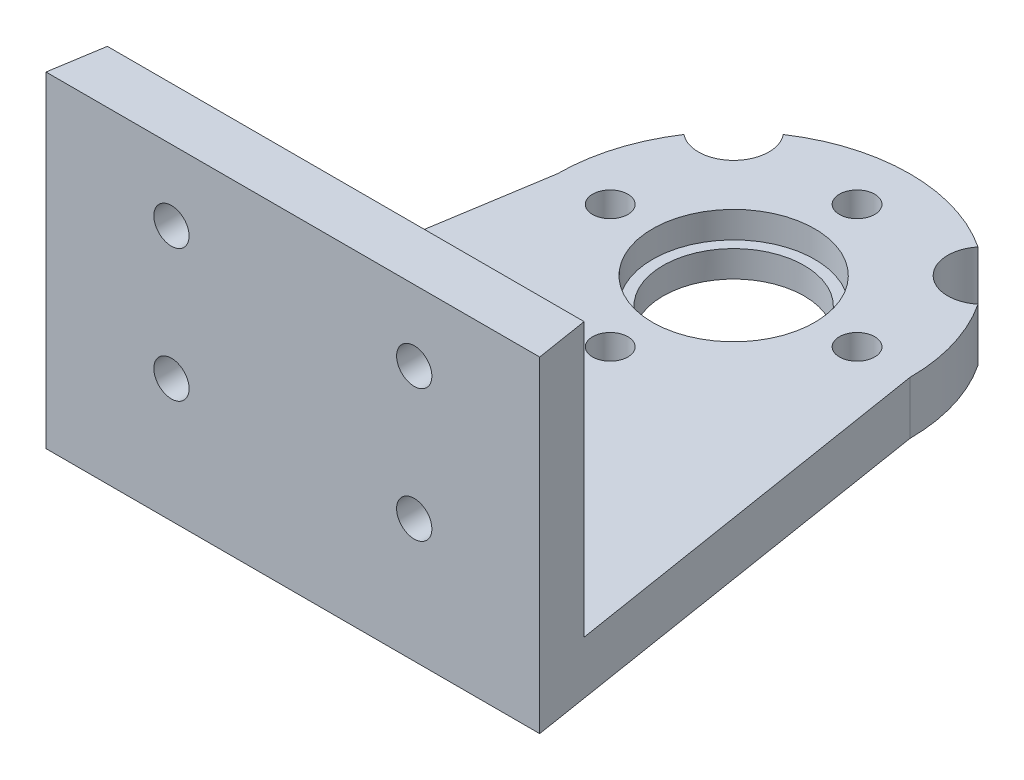
ISO-10303-21;
HEADER;
FILE_DESCRIPTION(('STEP AP214'),'2;1');
FILE_NAME('part.step','',(''),(''),'','','');
FILE_SCHEMA(('AUTOMOTIVE_DESIGN { 1 0 10303 214 1 1 1 1 }'));
ENDSEC;
DATA;
#1=APPLICATION_CONTEXT('core data for automotive mechanical design processes');
#2=APPLICATION_PROTOCOL_DEFINITION('international standard','automotive_design',2000,#1);
#3=PRODUCT_CONTEXT('',#1,'mechanical');
#4=PRODUCT('Part','Part','',(#3));
#5=PRODUCT_RELATED_PRODUCT_CATEGORY('part','',(#4));
#6=PRODUCT_DEFINITION_FORMATION('','',#4);
#7=PRODUCT_DEFINITION_CONTEXT('part definition',#1,'design');
#8=PRODUCT_DEFINITION('design','',#6,#7);
#9=PRODUCT_DEFINITION_SHAPE('','',#8);
#10=(LENGTH_UNIT() NAMED_UNIT(*) SI_UNIT(.MILLI.,.METRE.));
#11=(NAMED_UNIT(*) PLANE_ANGLE_UNIT() SI_UNIT($,.RADIAN.));
#12=(NAMED_UNIT(*) SI_UNIT($,.STERADIAN.) SOLID_ANGLE_UNIT());
#13=UNCERTAINTY_MEASURE_WITH_UNIT(LENGTH_MEASURE(1.E-05),#10,'distance_accuracy_value','');
#14=(GEOMETRIC_REPRESENTATION_CONTEXT(3) GLOBAL_UNCERTAINTY_ASSIGNED_CONTEXT((#13)) GLOBAL_UNIT_ASSIGNED_CONTEXT((#10,
#11,#12)) REPRESENTATION_CONTEXT('',''));
#15=CARTESIAN_POINT('',(0.,0.,0.));
#16=DIRECTION('',(0.,0.,1.));
#17=DIRECTION('',(1.,0.,0.));
#18=AXIS2_PLACEMENT_3D('',#15,#16,#17);
#19=CARTESIAN_POINT('',(0.,3.,0.));
#20=DIRECTION('',(0.,-1.,0.));
#21=DIRECTION('',(0.,0.,-1.));
#22=AXIS2_PLACEMENT_3D('',#19,#20,#21);
#23=CYLINDRICAL_SURFACE('',#22,10.);
#24=CARTESIAN_POINT('',(0.,0.,0.));
#25=DIRECTION('',(0.,1.,0.));
#26=DIRECTION('',(0.,0.,-1.));
#27=AXIS2_PLACEMENT_3D('',#24,#25,#26);
#28=CIRCLE('',#27,10.);
#29=CARTESIAN_POINT('',(10.,0.,0.));
#30=VERTEX_POINT('',#29);
#31=CARTESIAN_POINT('',(8.33677118357518,0.,-5.52252172768116));
#32=VERTEX_POINT('',#31);
#33=EDGE_CURVE('E216',#30,#32,#28,.T.);
#34=ORIENTED_EDGE('',*,*,#33,.T.);
#35=DIRECTION('',(0.,1.,0.));
#36=VECTOR('',#35,1.);
#37=CARTESIAN_POINT('',(8.33677118357519,-2.,-5.52252172768115));
#38=LINE('',#37,#36);
#39=CARTESIAN_POINT('',(8.33677118357519,3.,-5.52252172768115));
#40=VERTEX_POINT('',#39);
#41=EDGE_CURVE('E46',#32,#40,#38,.T.);
#42=ORIENTED_EDGE('',*,*,#41,.T.);
#43=CARTESIAN_POINT('',(0.,3.,0.));
#44=DIRECTION('',(0.,1.,0.));
#45=DIRECTION('',(0.,0.,-1.));
#46=AXIS2_PLACEMENT_3D('',#43,#44,#45);
#47=CIRCLE('',#46,10.);
#48=CARTESIAN_POINT('',(10.,3.,0.));
#49=VERTEX_POINT('',#48);
#50=EDGE_CURVE('E120',#49,#40,#47,.T.);
#51=ORIENTED_EDGE('',*,*,#50,.F.);
#52=DIRECTION('',(0.,-1.,0.));
#53=VECTOR('',#52,1.);
#54=CARTESIAN_POINT('',(10.,3.,0.));
#55=LINE('',#54,#53);
#56=EDGE_CURVE('E144',#49,#30,#55,.T.);
#57=ORIENTED_EDGE('',*,*,#56,.T.);
#58=EDGE_LOOP('',(#34,#42,#51,#57));
#59=FACE_BOUND('',#58,.T.);
#60=ADVANCED_FACE('F32',(#59),#23,.T.);
#61=CARTESIAN_POINT('',(5.52252172768112,3.,-8.33677118357521));
#62=VERTEX_POINT('',#61);
#63=CARTESIAN_POINT('',(-5.52252172768112,3.,-8.33677118357521));
#64=VERTEX_POINT('',#63);
#65=EDGE_CURVE('E117',#62,#64,#47,.T.);
#66=ORIENTED_EDGE('',*,*,#65,.F.);
#67=DIRECTION('',(0.,1.,0.));
#68=VECTOR('',#67,1.);
#69=CARTESIAN_POINT('',(5.52252172768112,-2.,-8.33677118357521));
#70=LINE('',#69,#68);
#71=CARTESIAN_POINT('',(5.52252172768113,0.,-8.3367711835752));
#72=VERTEX_POINT('',#71);
#73=EDGE_CURVE('E107',#62,#72,#70,.F.);
#74=ORIENTED_EDGE('',*,*,#73,.T.);
#75=CARTESIAN_POINT('',(-5.52252172768113,0.,-8.3367711835752));
#76=VERTEX_POINT('',#75);
#77=EDGE_CURVE('E54',#72,#76,#28,.T.);
#78=ORIENTED_EDGE('',*,*,#77,.T.);
#79=DIRECTION('',(0.,1.,0.));
#80=VECTOR('',#79,1.);
#81=CARTESIAN_POINT('',(-5.52252172768112,-2.,-8.33677118357521));
#82=LINE('',#81,#80);
#83=EDGE_CURVE('E124',#76,#64,#82,.T.);
#84=ORIENTED_EDGE('',*,*,#83,.T.);
#85=EDGE_LOOP('',(#66,#74,#78,#84));
#86=FACE_BOUND('',#85,.T.);
#87=ADVANCED_FACE('F123',(#86),#23,.T.);
#88=CARTESIAN_POINT('',(0.,-10.,0.));
#89=DIRECTION('',(0.,1.,0.));
#90=DIRECTION('',(0.,0.,1.));
#91=AXIS2_PLACEMENT_3D('',#88,#89,#90);
#92=CYLINDRICAL_SURFACE('',#91,4.);
#93=CARTESIAN_POINT('',(0.,0.,0.));
#94=DIRECTION('',(0.,-1.,0.));
#95=DIRECTION('',(0.,0.,-1.));
#96=AXIS2_PLACEMENT_3D('',#93,#94,#95);
#97=CIRCLE('',#96,4.);
#98=CARTESIAN_POINT('',(0.,0.,-4.));
#99=VERTEX_POINT('',#98);
#100=EDGE_CURVE('E212',#99,#99,#97,.T.);
#101=ORIENTED_EDGE('',*,*,#100,.T.);
#102=EDGE_LOOP('',(#101));
#103=FACE_BOUND('',#102,.T.);
#104=CARTESIAN_POINT('',(0.,1.5,0.));
#105=DIRECTION('',(0.,1.,0.));
#106=DIRECTION('',(0.,0.,1.));
#107=AXIS2_PLACEMENT_3D('',#104,#105,#106);
#108=CIRCLE('',#107,4.);
#109=CARTESIAN_POINT('',(0.,1.5,4.));
#110=VERTEX_POINT('',#109);
#111=EDGE_CURVE('E150',#110,#110,#108,.F.);
#112=ORIENTED_EDGE('',*,*,#111,.F.);
#113=EDGE_LOOP('',(#112));
#114=FACE_BOUND('',#113,.T.);
#115=ADVANCED_FACE('F347',(#103,#114),#92,.F.);
#116=CARTESIAN_POINT('',(0.,3.,0.));
#117=DIRECTION('',(0.,-1.,0.));
#118=DIRECTION('',(0.,0.,-1.));
#119=AXIS2_PLACEMENT_3D('',#116,#117,#118);
#120=PLANE('',#119);
#121=CARTESIAN_POINT('',(0.,3.,0.));
#122=DIRECTION('',(0.,1.,0.));
#123=DIRECTION('',(0.,0.,1.));
#124=AXIS2_PLACEMENT_3D('',#121,#122,#123);
#125=CIRCLE('',#124,4.6);
#126=CARTESIAN_POINT('',(0.,3.,4.6));
#127=VERTEX_POINT('',#126);
#128=EDGE_CURVE('E271',#127,#127,#125,.T.);
#129=ORIENTED_EDGE('',*,*,#128,.F.);
#130=EDGE_LOOP('',(#129));
#131=FACE_BOUND('',#130,.T.);
#132=CARTESIAN_POINT('',(-6.52,3.,19.));
#133=DIRECTION('',(0.,1.,0.));
#134=DIRECTION('',(0.,0.,1.));
#135=AXIS2_PLACEMENT_3D('',#132,#133,#134);
#136=CIRCLE('',#135,1.);
#137=CARTESIAN_POINT('',(-6.52,3.,20.));
#138=VERTEX_POINT('',#137);
#139=EDGE_CURVE('E131',#138,#138,#136,.T.);
#140=ORIENTED_EDGE('',*,*,#139,.F.);
#141=EDGE_LOOP('',(#140));
#142=FACE_BOUND('',#141,.T.);
#143=CARTESIAN_POINT('',(6.52,3.,19.));
#144=DIRECTION('',(0.,1.,0.));
#145=DIRECTION('',(0.,0.,-1.));
#146=AXIS2_PLACEMENT_3D('',#143,#144,#145);
#147=CIRCLE('',#146,1.);
#148=CARTESIAN_POINT('',(6.52,3.,18.));
#149=VERTEX_POINT('',#148);
#150=EDGE_CURVE('E185',#149,#149,#147,.T.);
#151=ORIENTED_EDGE('',*,*,#150,.F.);
#152=EDGE_LOOP('',(#151));
#153=FACE_BOUND('',#152,.T.);
#154=CARTESIAN_POINT('',(0.,3.,19.));
#155=DIRECTION('',(0.,1.,0.));
#156=DIRECTION('',(0.,0.,1.));
#157=AXIS2_PLACEMENT_3D('',#154,#155,#156);
#158=CIRCLE('',#157,1.);
#159=CARTESIAN_POINT('',(0.,3.,20.));
#160=VERTEX_POINT('',#159);
#161=EDGE_CURVE('E181',#160,#160,#158,.T.);
#162=ORIENTED_EDGE('',*,*,#161,.F.);
#163=EDGE_LOOP('',(#162));
#164=FACE_BOUND('',#163,.T.);
#165=CARTESIAN_POINT('',(0.,3.,7.));
#166=DIRECTION('',(0.,1.,0.));
#167=DIRECTION('',(0.,0.,1.));
#168=AXIS2_PLACEMENT_3D('',#165,#166,#167);
#169=CIRCLE('',#168,1.);
#170=CARTESIAN_POINT('',(0.,3.,8.));
#171=VERTEX_POINT('',#170);
#172=EDGE_CURVE('E175',#171,#171,#169,.T.);
#173=ORIENTED_EDGE('',*,*,#172,.F.);
#174=EDGE_LOOP('',(#173));
#175=FACE_BOUND('',#174,.T.);
#176=CARTESIAN_POINT('',(-7.,3.,0.));
#177=DIRECTION('',(0.,1.,0.));
#178=DIRECTION('',(0.,0.,1.));
#179=AXIS2_PLACEMENT_3D('',#176,#177,#178);
#180=CIRCLE('',#179,1.);
#181=CARTESIAN_POINT('',(-7.,3.,0.999999999999975));
#182=VERTEX_POINT('',#181);
#183=EDGE_CURVE('E169',#182,#182,#180,.T.);
#184=ORIENTED_EDGE('',*,*,#183,.F.);
#185=EDGE_LOOP('',(#184));
#186=FACE_BOUND('',#185,.T.);
#187=CARTESIAN_POINT('',(0.,3.,-7.));
#188=DIRECTION('',(0.,1.,0.));
#189=DIRECTION('',(0.,0.,1.));
#190=AXIS2_PLACEMENT_3D('',#187,#188,#189);
#191=CIRCLE('',#190,1.);
#192=CARTESIAN_POINT('',(0.,3.,-6.));
#193=VERTEX_POINT('',#192);
#194=EDGE_CURVE('E161',#193,#193,#191,.T.);
#195=ORIENTED_EDGE('',*,*,#194,.F.);
#196=EDGE_LOOP('',(#195));
#197=FACE_BOUND('',#196,.T.);
#198=CARTESIAN_POINT('',(7.,3.,0.));
#199=DIRECTION('',(0.,1.,0.));
#200=DIRECTION('',(0.,0.,1.));
#201=AXIS2_PLACEMENT_3D('',#198,#199,#200);
#202=CIRCLE('',#201,1.);
#203=CARTESIAN_POINT('',(7.,3.,1.00000000000007));
#204=VERTEX_POINT('',#203);
#205=EDGE_CURVE('E162',#204,#204,#202,.T.);
#206=ORIENTED_EDGE('',*,*,#205,.F.);
#207=EDGE_LOOP('',(#206));
#208=FACE_BOUND('',#207,.T.);
#209=ORIENTED_EDGE('',*,*,#50,.T.);
#210=CARTESIAN_POINT('',(7.07106781186546,3.,-7.07106781186549));
#211=DIRECTION('',(0.,1.,0.));
#212=DIRECTION('',(0.,0.,-1.));
#213=AXIS2_PLACEMENT_3D('',#210,#211,#212);
#214=CIRCLE('',#213,2.);
#215=EDGE_CURVE('E110',#62,#40,#214,.T.);
#216=ORIENTED_EDGE('',*,*,#215,.F.);
#217=ORIENTED_EDGE('',*,*,#65,.T.);
#218=CARTESIAN_POINT('',(-7.07106781186546,3.,-7.07106781186549));
#219=DIRECTION('',(0.,1.,0.));
#220=DIRECTION('',(0.,0.,1.));
#221=AXIS2_PLACEMENT_3D('',#218,#219,#220);
#222=CIRCLE('',#221,2.);
#223=CARTESIAN_POINT('',(-8.33677118357519,3.,-5.52252172768115));
#224=VERTEX_POINT('',#223);
#225=EDGE_CURVE('E279',#224,#64,#222,.T.);
#226=ORIENTED_EDGE('',*,*,#225,.F.);
#227=CARTESIAN_POINT('',(-10.,3.,0.));
#228=VERTEX_POINT('',#227);
#229=EDGE_CURVE('E125',#224,#228,#47,.T.);
#230=ORIENTED_EDGE('',*,*,#229,.T.);
#231=DIRECTION('',(-0.157990501106673,0.,0.987440631916705));
#232=VECTOR('',#231,1.);
#233=CARTESIAN_POINT('',(-10.,3.,0.));
#234=LINE('',#233,#232);
#235=CARTESIAN_POINT('',(-13.52,3.,22.));
#236=VERTEX_POINT('',#235);
#237=EDGE_CURVE('E127',#228,#236,#234,.T.);
#238=ORIENTED_EDGE('',*,*,#237,.T.);
#239=DIRECTION('',(-1.,0.,0.));
#240=VECTOR('',#239,1.);
#241=CARTESIAN_POINT('',(-13.52,3.,22.));
#242=LINE('',#241,#240);
#243=CARTESIAN_POINT('',(13.52,3.,22.));
#244=VERTEX_POINT('',#243);
#245=EDGE_CURVE('E145',#244,#236,#242,.T.);
#246=ORIENTED_EDGE('',*,*,#245,.F.);
#247=DIRECTION('',(-0.157990501106673,0.,-0.987440631916705));
#248=VECTOR('',#247,1.);
#249=CARTESIAN_POINT('',(10.,3.,0.));
#250=LINE('',#249,#248);
#251=EDGE_CURVE('E140',#244,#49,#250,.T.);
#252=ORIENTED_EDGE('',*,*,#251,.T.);
#253=EDGE_LOOP('',(#209,#216,#217,#226,#230,#238,#246,#252));
#254=FACE_BOUND('',#253,.T.);
#255=ADVANCED_FACE('F115',(#131,#142,#153,#164,#175,#186,#197,#208,#254),#120,.F.);
#256=ORIENTED_EDGE('',*,*,#229,.F.);
#257=DIRECTION('',(0.,1.,0.));
#258=VECTOR('',#257,1.);
#259=CARTESIAN_POINT('',(-8.33677118357519,-2.,-5.52252172768115));
#260=LINE('',#259,#258);
#261=CARTESIAN_POINT('',(-8.33677118357518,0.,-5.52252172768116));
#262=VERTEX_POINT('',#261);
#263=EDGE_CURVE('E277',#224,#262,#260,.F.);
#264=ORIENTED_EDGE('',*,*,#263,.T.);
#265=CARTESIAN_POINT('',(-10.,0.,0.));
#266=VERTEX_POINT('',#265);
#267=EDGE_CURVE('E214',#262,#266,#28,.T.);
#268=ORIENTED_EDGE('',*,*,#267,.T.);
#269=DIRECTION('',(0.,-1.,0.));
#270=VECTOR('',#269,1.);
#271=CARTESIAN_POINT('',(-10.,3.,0.));
#272=LINE('',#271,#270);
#273=EDGE_CURVE('E219',#228,#266,#272,.T.);
#274=ORIENTED_EDGE('',*,*,#273,.F.);
#275=EDGE_LOOP('',(#256,#264,#268,#274));
#276=FACE_BOUND('',#275,.T.);
#277=ADVANCED_FACE('F34',(#276),#23,.T.);
#278=CARTESIAN_POINT('',(-10.,3.,0.));
#279=DIRECTION('',(0.987440631916705,0.,0.157990501106673));
#280=DIRECTION('',(0.157990501106673,0.,-0.987440631916705));
#281=AXIS2_PLACEMENT_3D('',#278,#279,#280);
#282=PLANE('',#281);
#283=DIRECTION('',(-0.157990501106673,0.,0.987440631916705));
#284=VECTOR('',#283,1.);
#285=CARTESIAN_POINT('',(-10.,0.,0.));
#286=LINE('',#285,#284);
#287=CARTESIAN_POINT('',(-14.,0.,25.));
#288=VERTEX_POINT('',#287);
#289=EDGE_CURVE('E233',#266,#288,#286,.T.);
#290=ORIENTED_EDGE('',*,*,#289,.T.);
#291=DIRECTION('',(0.,-1.,0.));
#292=VECTOR('',#291,1.);
#293=CARTESIAN_POINT('',(-14.,3.,25.));
#294=LINE('',#293,#292);
#295=CARTESIAN_POINT('',(-14.,18.5,25.));
#296=VERTEX_POINT('',#295);
#297=EDGE_CURVE('E222',#296,#288,#294,.T.);
#298=ORIENTED_EDGE('',*,*,#297,.F.);
#299=DIRECTION('',(-0.157990501106673,0.,0.987440631916705));
#300=VECTOR('',#299,1.);
#301=CARTESIAN_POINT('',(-13.52,18.5,22.));
#302=LINE('',#301,#300);
#303=CARTESIAN_POINT('',(-13.52,18.5,22.));
#304=VERTEX_POINT('',#303);
#305=EDGE_CURVE('E149',#304,#296,#302,.T.);
#306=ORIENTED_EDGE('',*,*,#305,.F.);
#307=DIRECTION('',(0.,-1.,0.));
#308=VECTOR('',#307,1.);
#309=CARTESIAN_POINT('',(-13.52,18.5,22.));
#310=LINE('',#309,#308);
#311=EDGE_CURVE('E151',#304,#236,#310,.T.);
#312=ORIENTED_EDGE('',*,*,#311,.T.);
#313=ORIENTED_EDGE('',*,*,#237,.F.);
#314=ORIENTED_EDGE('',*,*,#273,.T.);
#315=EDGE_LOOP('',(#290,#298,#306,#312,#313,#314));
#316=FACE_BOUND('',#315,.T.);
#317=ADVANCED_FACE('F325',(#316),#282,.F.);
#318=CARTESIAN_POINT('',(-14.,3.,25.));
#319=DIRECTION('',(0.,0.,-1.));
#320=DIRECTION('',(-1.,0.,0.));
#321=AXIS2_PLACEMENT_3D('',#318,#319,#320);
#322=PLANE('',#321);
#323=CARTESIAN_POINT('',(6.88499999999998,7.,25.));
#324=DIRECTION('',(0.,0.,-1.));
#325=DIRECTION('',(-1.,0.,0.));
#326=AXIS2_PLACEMENT_3D('',#323,#324,#325);
#327=CIRCLE('',#326,1.);
#328=CARTESIAN_POINT('',(5.88499999999998,7.,25.));
#329=VERTEX_POINT('',#328);
#330=EDGE_CURVE('E287',#329,#329,#327,.T.);
#331=ORIENTED_EDGE('',*,*,#330,.T.);
#332=EDGE_LOOP('',(#331));
#333=FACE_BOUND('',#332,.T.);
#334=CARTESIAN_POINT('',(-6.88499999999999,14.5,25.));
#335=DIRECTION('',(0.,0.,-1.));
#336=DIRECTION('',(-1.,0.,0.));
#337=AXIS2_PLACEMENT_3D('',#334,#335,#336);
#338=CIRCLE('',#337,1.);
#339=CARTESIAN_POINT('',(-7.885,14.5,25.));
#340=VERTEX_POINT('',#339);
#341=EDGE_CURVE('E290',#340,#340,#338,.T.);
#342=ORIENTED_EDGE('',*,*,#341,.T.);
#343=EDGE_LOOP('',(#342));
#344=FACE_BOUND('',#343,.T.);
#345=CARTESIAN_POINT('',(6.88500000000001,14.5,25.));
#346=DIRECTION('',(0.,0.,-1.));
#347=DIRECTION('',(-1.,0.,0.));
#348=AXIS2_PLACEMENT_3D('',#345,#346,#347);
#349=CIRCLE('',#348,1.);
#350=CARTESIAN_POINT('',(5.88500000000001,14.5,25.));
#351=VERTEX_POINT('',#350);
#352=EDGE_CURVE('E293',#351,#351,#349,.T.);
#353=ORIENTED_EDGE('',*,*,#352,.T.);
#354=EDGE_LOOP('',(#353));
#355=FACE_BOUND('',#354,.T.);
#356=CARTESIAN_POINT('',(-6.88500000000002,7.,25.));
#357=DIRECTION('',(0.,0.,-1.));
#358=DIRECTION('',(-1.,0.,0.));
#359=AXIS2_PLACEMENT_3D('',#356,#357,#358);
#360=CIRCLE('',#359,1.);
#361=CARTESIAN_POINT('',(-7.88500000000002,7.,25.));
#362=VERTEX_POINT('',#361);
#363=EDGE_CURVE('E121',#362,#362,#360,.T.);
#364=ORIENTED_EDGE('',*,*,#363,.T.);
#365=EDGE_LOOP('',(#364));
#366=FACE_BOUND('',#365,.T.);
#367=DIRECTION('',(1.,0.,0.));
#368=VECTOR('',#367,1.);
#369=CARTESIAN_POINT('',(-14.,0.,25.));
#370=LINE('',#369,#368);
#371=CARTESIAN_POINT('',(14.,0.,25.));
#372=VERTEX_POINT('',#371);
#373=EDGE_CURVE('E231',#288,#372,#370,.T.);
#374=ORIENTED_EDGE('',*,*,#373,.T.);
#375=DIRECTION('',(0.,-1.,0.));
#376=VECTOR('',#375,1.);
#377=CARTESIAN_POINT('',(14.,3.,25.));
#378=LINE('',#377,#376);
#379=CARTESIAN_POINT('',(14.,18.5,25.));
#380=VERTEX_POINT('',#379);
#381=EDGE_CURVE('E225',#380,#372,#378,.T.);
#382=ORIENTED_EDGE('',*,*,#381,.F.);
#383=DIRECTION('',(1.,0.,0.));
#384=VECTOR('',#383,1.);
#385=CARTESIAN_POINT('',(-14.,18.5,25.));
#386=LINE('',#385,#384);
#387=EDGE_CURVE('E265',#296,#380,#386,.T.);
#388=ORIENTED_EDGE('',*,*,#387,.F.);
#389=ORIENTED_EDGE('',*,*,#297,.T.);
#390=EDGE_LOOP('',(#374,#382,#388,#389));
#391=FACE_BOUND('',#390,.T.);
#392=ADVANCED_FACE('F324',(#333,#344,#355,#366,#391),#322,.F.);
#393=CARTESIAN_POINT('',(10.,3.,0.));
#394=DIRECTION('',(-0.987440631916705,0.,0.157990501106673));
#395=DIRECTION('',(0.157990501106673,0.,0.987440631916705));
#396=AXIS2_PLACEMENT_3D('',#393,#394,#395);
#397=PLANE('',#396);
#398=DIRECTION('',(-0.157990501106673,0.,-0.987440631916705));
#399=VECTOR('',#398,1.);
#400=CARTESIAN_POINT('',(10.,0.,0.));
#401=LINE('',#400,#399);
#402=EDGE_CURVE('E128',#372,#30,#401,.T.);
#403=ORIENTED_EDGE('',*,*,#402,.T.);
#404=ORIENTED_EDGE('',*,*,#56,.F.);
#405=ORIENTED_EDGE('',*,*,#251,.F.);
#406=DIRECTION('',(0.,-1.,0.));
#407=VECTOR('',#406,1.);
#408=CARTESIAN_POINT('',(13.52,18.5,22.));
#409=LINE('',#408,#407);
#410=CARTESIAN_POINT('',(13.52,18.5,22.));
#411=VERTEX_POINT('',#410);
#412=EDGE_CURVE('E165',#411,#244,#409,.T.);
#413=ORIENTED_EDGE('',*,*,#412,.F.);
#414=DIRECTION('',(-0.157990501106673,0.,-0.987440631916705));
#415=VECTOR('',#414,1.);
#416=CARTESIAN_POINT('',(14.,18.5,25.));
#417=LINE('',#416,#415);
#418=EDGE_CURVE('E262',#380,#411,#417,.T.);
#419=ORIENTED_EDGE('',*,*,#418,.F.);
#420=ORIENTED_EDGE('',*,*,#381,.T.);
#421=EDGE_LOOP('',(#403,#404,#405,#413,#419,#420));
#422=FACE_BOUND('',#421,.T.);
#423=ADVANCED_FACE('F201',(#422),#397,.F.);
#424=CARTESIAN_POINT('',(0.,0.,0.));
#425=DIRECTION('',(0.,-1.,0.));
#426=DIRECTION('',(0.,0.,-1.));
#427=AXIS2_PLACEMENT_3D('',#424,#425,#426);
#428=PLANE('',#427);
#429=CARTESIAN_POINT('',(7.07106781186546,0.,-7.07106781186549));
#430=DIRECTION('',(0.,-1.,0.));
#431=DIRECTION('',(0.,0.,-1.));
#432=AXIS2_PLACEMENT_3D('',#429,#430,#431);
#433=CIRCLE('',#432,2.);
#434=EDGE_CURVE('E11',#32,#72,#433,.T.);
#435=ORIENTED_EDGE('',*,*,#434,.F.);
#436=ORIENTED_EDGE('',*,*,#33,.F.);
#437=ORIENTED_EDGE('',*,*,#402,.F.);
#438=ORIENTED_EDGE('',*,*,#373,.F.);
#439=ORIENTED_EDGE('',*,*,#289,.F.);
#440=ORIENTED_EDGE('',*,*,#267,.F.);
#441=CARTESIAN_POINT('',(-7.07106781186546,0.,-7.07106781186549));
#442=DIRECTION('',(0.,-1.,0.));
#443=DIRECTION('',(0.,0.,-1.));
#444=AXIS2_PLACEMENT_3D('',#441,#442,#443);
#445=CIRCLE('',#444,2.);
#446=EDGE_CURVE('E40',#76,#262,#445,.T.);
#447=ORIENTED_EDGE('',*,*,#446,.F.);
#448=ORIENTED_EDGE('',*,*,#77,.F.);
#449=EDGE_LOOP('',(#435,#436,#437,#438,#439,#440,#447,#448));
#450=FACE_BOUND('',#449,.T.);
#451=CARTESIAN_POINT('',(7.,0.,0.));
#452=DIRECTION('',(0.,1.,0.));
#453=DIRECTION('',(0.,0.,1.));
#454=AXIS2_PLACEMENT_3D('',#451,#452,#453);
#455=CIRCLE('',#454,1.);
#456=CARTESIAN_POINT('',(7.,0.,1.00000000000007));
#457=VERTEX_POINT('',#456);
#458=EDGE_CURVE('E158',#457,#457,#455,.T.);
#459=ORIENTED_EDGE('',*,*,#458,.T.);
#460=EDGE_LOOP('',(#459));
#461=FACE_BOUND('',#460,.T.);
#462=CARTESIAN_POINT('',(0.,0.,-7.));
#463=DIRECTION('',(0.,1.,0.));
#464=DIRECTION('',(0.,0.,1.));
#465=AXIS2_PLACEMENT_3D('',#462,#463,#464);
#466=CIRCLE('',#465,1.);
#467=CARTESIAN_POINT('',(0.,0.,-6.));
#468=VERTEX_POINT('',#467);
#469=EDGE_CURVE('E166',#468,#468,#466,.T.);
#470=ORIENTED_EDGE('',*,*,#469,.T.);
#471=EDGE_LOOP('',(#470));
#472=FACE_BOUND('',#471,.T.);
#473=CARTESIAN_POINT('',(-7.,0.,0.));
#474=DIRECTION('',(0.,1.,0.));
#475=DIRECTION('',(0.,0.,1.));
#476=AXIS2_PLACEMENT_3D('',#473,#474,#475);
#477=CIRCLE('',#476,1.);
#478=CARTESIAN_POINT('',(-7.,0.,0.999999999999975));
#479=VERTEX_POINT('',#478);
#480=EDGE_CURVE('E172',#479,#479,#477,.T.);
#481=ORIENTED_EDGE('',*,*,#480,.T.);
#482=EDGE_LOOP('',(#481));
#483=FACE_BOUND('',#482,.T.);
#484=CARTESIAN_POINT('',(0.,0.,7.));
#485=DIRECTION('',(0.,1.,0.));
#486=DIRECTION('',(0.,0.,1.));
#487=AXIS2_PLACEMENT_3D('',#484,#485,#486);
#488=CIRCLE('',#487,1.);
#489=CARTESIAN_POINT('',(0.,0.,8.));
#490=VERTEX_POINT('',#489);
#491=EDGE_CURVE('E178',#490,#490,#488,.T.);
#492=ORIENTED_EDGE('',*,*,#491,.T.);
#493=EDGE_LOOP('',(#492));
#494=FACE_BOUND('',#493,.T.);
#495=CARTESIAN_POINT('',(0.,0.,19.));
#496=DIRECTION('',(0.,-1.,0.));
#497=DIRECTION('',(0.,0.,-1.));
#498=AXIS2_PLACEMENT_3D('',#495,#496,#497);
#499=CIRCLE('',#498,1.);
#500=CARTESIAN_POINT('',(0.,0.,18.));
#501=VERTEX_POINT('',#500);
#502=EDGE_CURVE('E141',#501,#501,#499,.T.);
#503=ORIENTED_EDGE('',*,*,#502,.F.);
#504=EDGE_LOOP('',(#503));
#505=FACE_BOUND('',#504,.T.);
#506=CARTESIAN_POINT('',(6.52,0.,19.));
#507=DIRECTION('',(0.,-1.,0.));
#508=DIRECTION('',(0.,0.,-1.));
#509=AXIS2_PLACEMENT_3D('',#506,#507,#508);
#510=CIRCLE('',#509,1.);
#511=CARTESIAN_POINT('',(6.52,0.,18.));
#512=VERTEX_POINT('',#511);
#513=EDGE_CURVE('E187',#512,#512,#510,.T.);
#514=ORIENTED_EDGE('',*,*,#513,.F.);
#515=EDGE_LOOP('',(#514));
#516=FACE_BOUND('',#515,.T.);
#517=CARTESIAN_POINT('',(-6.52,0.,19.));
#518=DIRECTION('',(0.,-1.,0.));
#519=DIRECTION('',(0.,0.,-1.));
#520=AXIS2_PLACEMENT_3D('',#517,#518,#519);
#521=CIRCLE('',#520,1.);
#522=CARTESIAN_POINT('',(-6.52,0.,18.));
#523=VERTEX_POINT('',#522);
#524=EDGE_CURVE('E209',#523,#523,#521,.T.);
#525=ORIENTED_EDGE('',*,*,#524,.F.);
#526=EDGE_LOOP('',(#525));
#527=FACE_BOUND('',#526,.T.);
#528=ORIENTED_EDGE('',*,*,#100,.F.);
#529=EDGE_LOOP('',(#528));
#530=FACE_BOUND('',#529,.T.);
#531=ADVANCED_FACE('F197',(#450,#461,#472,#483,#494,#505,#516,#527,#530),#428,.T.);
#532=CARTESIAN_POINT('',(-6.52,-10.,19.));
#533=DIRECTION('',(0.,1.,0.));
#534=DIRECTION('',(0.,0.,1.));
#535=AXIS2_PLACEMENT_3D('',#532,#533,#534);
#536=CYLINDRICAL_SURFACE('',#535,1.);
#537=ORIENTED_EDGE('',*,*,#524,.T.);
#538=EDGE_LOOP('',(#537));
#539=FACE_BOUND('',#538,.T.);
#540=ORIENTED_EDGE('',*,*,#139,.T.);
#541=EDGE_LOOP('',(#540));
#542=FACE_BOUND('',#541,.T.);
#543=ADVANCED_FACE('F200',(#539,#542),#536,.F.);
#544=CARTESIAN_POINT('',(6.52,-10.,19.));
#545=DIRECTION('',(0.,1.,0.));
#546=DIRECTION('',(0.,0.,1.));
#547=AXIS2_PLACEMENT_3D('',#544,#545,#546);
#548=CYLINDRICAL_SURFACE('',#547,1.);
#549=ORIENTED_EDGE('',*,*,#513,.T.);
#550=EDGE_LOOP('',(#549));
#551=FACE_BOUND('',#550,.T.);
#552=ORIENTED_EDGE('',*,*,#150,.T.);
#553=EDGE_LOOP('',(#552));
#554=FACE_BOUND('',#553,.T.);
#555=ADVANCED_FACE('F543',(#551,#554),#548,.F.);
#556=CARTESIAN_POINT('',(0.,-10.,19.));
#557=DIRECTION('',(0.,1.,0.));
#558=DIRECTION('',(0.,0.,1.));
#559=AXIS2_PLACEMENT_3D('',#556,#557,#558);
#560=CYLINDRICAL_SURFACE('',#559,1.);
#561=ORIENTED_EDGE('',*,*,#502,.T.);
#562=EDGE_LOOP('',(#561));
#563=FACE_BOUND('',#562,.T.);
#564=ORIENTED_EDGE('',*,*,#161,.T.);
#565=EDGE_LOOP('',(#564));
#566=FACE_BOUND('',#565,.T.);
#567=ADVANCED_FACE('F194',(#563,#566),#560,.F.);
#568=CARTESIAN_POINT('',(0.,0.,7.));
#569=DIRECTION('',(0.,1.,0.));
#570=DIRECTION('',(0.,0.,1.));
#571=AXIS2_PLACEMENT_3D('',#568,#569,#570);
#572=CYLINDRICAL_SURFACE('',#571,1.);
#573=ORIENTED_EDGE('',*,*,#491,.F.);
#574=EDGE_LOOP('',(#573));
#575=FACE_BOUND('',#574,.T.);
#576=ORIENTED_EDGE('',*,*,#172,.T.);
#577=EDGE_LOOP('',(#576));
#578=FACE_BOUND('',#577,.T.);
#579=ADVANCED_FACE('F524',(#575,#578),#572,.F.);
#580=CARTESIAN_POINT('',(-7.,0.,0.));
#581=DIRECTION('',(0.,1.,0.));
#582=DIRECTION('',(0.,0.,1.));
#583=AXIS2_PLACEMENT_3D('',#580,#581,#582);
#584=CYLINDRICAL_SURFACE('',#583,1.);
#585=ORIENTED_EDGE('',*,*,#480,.F.);
#586=EDGE_LOOP('',(#585));
#587=FACE_BOUND('',#586,.T.);
#588=ORIENTED_EDGE('',*,*,#183,.T.);
#589=EDGE_LOOP('',(#588));
#590=FACE_BOUND('',#589,.T.);
#591=ADVANCED_FACE('F514',(#587,#590),#584,.F.);
#592=CARTESIAN_POINT('',(0.,0.,-7.));
#593=DIRECTION('',(0.,1.,0.));
#594=DIRECTION('',(0.,0.,1.));
#595=AXIS2_PLACEMENT_3D('',#592,#593,#594);
#596=CYLINDRICAL_SURFACE('',#595,1.);
#597=ORIENTED_EDGE('',*,*,#469,.F.);
#598=EDGE_LOOP('',(#597));
#599=FACE_BOUND('',#598,.T.);
#600=ORIENTED_EDGE('',*,*,#194,.T.);
#601=EDGE_LOOP('',(#600));
#602=FACE_BOUND('',#601,.T.);
#603=ADVANCED_FACE('F504',(#599,#602),#596,.F.);
#604=CARTESIAN_POINT('',(7.,0.,0.));
#605=DIRECTION('',(0.,1.,0.));
#606=DIRECTION('',(0.,0.,1.));
#607=AXIS2_PLACEMENT_3D('',#604,#605,#606);
#608=CYLINDRICAL_SURFACE('',#607,1.);
#609=ORIENTED_EDGE('',*,*,#458,.F.);
#610=EDGE_LOOP('',(#609));
#611=FACE_BOUND('',#610,.T.);
#612=ORIENTED_EDGE('',*,*,#205,.T.);
#613=EDGE_LOOP('',(#612));
#614=FACE_BOUND('',#613,.T.);
#615=ADVANCED_FACE('F313',(#611,#614),#608,.F.);
#616=CARTESIAN_POINT('',(-13.52,18.5,22.));
#617=DIRECTION('',(0.,0.,1.));
#618=DIRECTION('',(1.,0.,0.));
#619=AXIS2_PLACEMENT_3D('',#616,#617,#618);
#620=PLANE('',#619);
#621=CARTESIAN_POINT('',(6.88499999999998,7.,22.));
#622=DIRECTION('',(0.,0.,-1.));
#623=DIRECTION('',(-1.,0.,0.));
#624=AXIS2_PLACEMENT_3D('',#621,#622,#623);
#625=CIRCLE('',#624,1.);
#626=CARTESIAN_POINT('',(5.88499999999998,7.,22.));
#627=VERTEX_POINT('',#626);
#628=EDGE_CURVE('E296',#627,#627,#625,.T.);
#629=ORIENTED_EDGE('',*,*,#628,.F.);
#630=EDGE_LOOP('',(#629));
#631=FACE_BOUND('',#630,.T.);
#632=CARTESIAN_POINT('',(-6.88499999999999,14.5,22.));
#633=DIRECTION('',(0.,0.,-1.));
#634=DIRECTION('',(-1.,0.,0.));
#635=AXIS2_PLACEMENT_3D('',#632,#633,#634);
#636=CIRCLE('',#635,1.);
#637=CARTESIAN_POINT('',(-7.885,14.5,22.));
#638=VERTEX_POINT('',#637);
#639=EDGE_CURVE('E300',#638,#638,#636,.T.);
#640=ORIENTED_EDGE('',*,*,#639,.F.);
#641=EDGE_LOOP('',(#640));
#642=FACE_BOUND('',#641,.T.);
#643=CARTESIAN_POINT('',(6.88500000000001,14.5,22.));
#644=DIRECTION('',(0.,0.,-1.));
#645=DIRECTION('',(-1.,0.,0.));
#646=AXIS2_PLACEMENT_3D('',#643,#644,#645);
#647=CIRCLE('',#646,1.);
#648=CARTESIAN_POINT('',(5.88500000000001,14.5,22.));
#649=VERTEX_POINT('',#648);
#650=EDGE_CURVE('E297',#649,#649,#647,.T.);
#651=ORIENTED_EDGE('',*,*,#650,.F.);
#652=EDGE_LOOP('',(#651));
#653=FACE_BOUND('',#652,.T.);
#654=CARTESIAN_POINT('',(-6.88500000000002,7.,22.));
#655=DIRECTION('',(0.,0.,-1.));
#656=DIRECTION('',(-1.,0.,0.));
#657=AXIS2_PLACEMENT_3D('',#654,#655,#656);
#658=CIRCLE('',#657,1.);
#659=CARTESIAN_POINT('',(-7.88500000000002,7.,22.));
#660=VERTEX_POINT('',#659);
#661=EDGE_CURVE('E284',#660,#660,#658,.T.);
#662=ORIENTED_EDGE('',*,*,#661,.F.);
#663=EDGE_LOOP('',(#662));
#664=FACE_BOUND('',#663,.T.);
#665=ORIENTED_EDGE('',*,*,#245,.T.);
#666=ORIENTED_EDGE('',*,*,#311,.F.);
#667=DIRECTION('',(-1.,0.,0.));
#668=VECTOR('',#667,1.);
#669=CARTESIAN_POINT('',(-13.52,18.5,22.));
#670=LINE('',#669,#668);
#671=EDGE_CURVE('E156',#411,#304,#670,.T.);
#672=ORIENTED_EDGE('',*,*,#671,.F.);
#673=ORIENTED_EDGE('',*,*,#412,.T.);
#674=EDGE_LOOP('',(#665,#666,#672,#673));
#675=FACE_BOUND('',#674,.T.);
#676=ADVANCED_FACE('F309',(#631,#642,#653,#664,#675),#620,.F.);
#677=CARTESIAN_POINT('',(0.,18.5,0.));
#678=DIRECTION('',(0.,1.,0.));
#679=DIRECTION('',(0.,0.,1.));
#680=AXIS2_PLACEMENT_3D('',#677,#678,#679);
#681=PLANE('',#680);
#682=ORIENTED_EDGE('',*,*,#305,.T.);
#683=ORIENTED_EDGE('',*,*,#387,.T.);
#684=ORIENTED_EDGE('',*,*,#418,.T.);
#685=ORIENTED_EDGE('',*,*,#671,.T.);
#686=EDGE_LOOP('',(#682,#683,#684,#685));
#687=FACE_BOUND('',#686,.T.);
#688=ADVANCED_FACE('F312',(#687),#681,.T.);
#689=CARTESIAN_POINT('',(0.,1.5,0.));
#690=DIRECTION('',(0.,1.,0.));
#691=DIRECTION('',(0.,0.,1.));
#692=AXIS2_PLACEMENT_3D('',#689,#690,#691);
#693=PLANE('',#692);
#694=CARTESIAN_POINT('',(0.,1.5,0.));
#695=DIRECTION('',(0.,1.,0.));
#696=DIRECTION('',(0.,0.,1.));
#697=AXIS2_PLACEMENT_3D('',#694,#695,#696);
#698=CIRCLE('',#697,4.6);
#699=CARTESIAN_POINT('',(0.,1.5,4.6));
#700=VERTEX_POINT('',#699);
#701=EDGE_CURVE('E249',#700,#700,#698,.T.);
#702=ORIENTED_EDGE('',*,*,#701,.T.);
#703=EDGE_LOOP('',(#702));
#704=FACE_BOUND('',#703,.T.);
#705=ORIENTED_EDGE('',*,*,#111,.T.);
#706=EDGE_LOOP('',(#705));
#707=FACE_BOUND('',#706,.T.);
#708=ADVANCED_FACE('F339',(#704,#707),#693,.T.);
#709=CARTESIAN_POINT('',(0.,1.5,0.));
#710=DIRECTION('',(0.,1.,0.));
#711=DIRECTION('',(0.,0.,1.));
#712=AXIS2_PLACEMENT_3D('',#709,#710,#711);
#713=CYLINDRICAL_SURFACE('',#712,4.6);
#714=ORIENTED_EDGE('',*,*,#701,.F.);
#715=EDGE_LOOP('',(#714));
#716=FACE_BOUND('',#715,.T.);
#717=ORIENTED_EDGE('',*,*,#128,.T.);
#718=EDGE_LOOP('',(#717));
#719=FACE_BOUND('',#718,.T.);
#720=ADVANCED_FACE('F331',(#716,#719),#713,.F.);
#721=CARTESIAN_POINT('',(-7.07106781186546,-7.,-7.07106781186549));
#722=DIRECTION('',(0.,1.,0.));
#723=DIRECTION('',(0.,0.,1.));
#724=AXIS2_PLACEMENT_3D('',#721,#722,#723);
#725=CYLINDRICAL_SURFACE('',#724,2.);
#726=ORIENTED_EDGE('',*,*,#446,.T.);
#727=ORIENTED_EDGE('',*,*,#263,.F.);
#728=ORIENTED_EDGE('',*,*,#225,.T.);
#729=ORIENTED_EDGE('',*,*,#83,.F.);
#730=EDGE_LOOP('',(#726,#727,#728,#729));
#731=FACE_BOUND('',#730,.T.);
#732=ADVANCED_FACE('F329',(#731),#725,.F.);
#733=CARTESIAN_POINT('',(7.07106781186546,-7.,-7.07106781186549));
#734=DIRECTION('',(0.,1.,0.));
#735=DIRECTION('',(0.,0.,1.));
#736=AXIS2_PLACEMENT_3D('',#733,#734,#735);
#737=CYLINDRICAL_SURFACE('',#736,2.);
#738=ORIENTED_EDGE('',*,*,#434,.T.);
#739=ORIENTED_EDGE('',*,*,#73,.F.);
#740=ORIENTED_EDGE('',*,*,#215,.T.);
#741=ORIENTED_EDGE('',*,*,#41,.F.);
#742=EDGE_LOOP('',(#738,#739,#740,#741));
#743=FACE_BOUND('',#742,.T.);
#744=ADVANCED_FACE('F109',(#743),#737,.F.);
#745=CARTESIAN_POINT('',(-6.88500000000002,7.,32.));
#746=DIRECTION('',(0.,0.,-1.));
#747=DIRECTION('',(-1.,0.,0.));
#748=AXIS2_PLACEMENT_3D('',#745,#746,#747);
#749=CYLINDRICAL_SURFACE('',#748,1.);
#750=ORIENTED_EDGE('',*,*,#661,.T.);
#751=EDGE_LOOP('',(#750));
#752=FACE_BOUND('',#751,.T.);
#753=ORIENTED_EDGE('',*,*,#363,.F.);
#754=EDGE_LOOP('',(#753));
#755=FACE_BOUND('',#754,.T.);
#756=ADVANCED_FACE('F337',(#752,#755),#749,.F.);
#757=CARTESIAN_POINT('',(6.88500000000001,14.5,32.));
#758=DIRECTION('',(0.,0.,-1.));
#759=DIRECTION('',(-1.,0.,0.));
#760=AXIS2_PLACEMENT_3D('',#757,#758,#759);
#761=CYLINDRICAL_SURFACE('',#760,1.);
#762=ORIENTED_EDGE('',*,*,#650,.T.);
#763=EDGE_LOOP('',(#762));
#764=FACE_BOUND('',#763,.T.);
#765=ORIENTED_EDGE('',*,*,#352,.F.);
#766=EDGE_LOOP('',(#765));
#767=FACE_BOUND('',#766,.T.);
#768=ADVANCED_FACE('F378',(#764,#767),#761,.F.);
#769=CARTESIAN_POINT('',(-6.88499999999999,14.5,32.));
#770=DIRECTION('',(0.,0.,-1.));
#771=DIRECTION('',(-1.,0.,0.));
#772=AXIS2_PLACEMENT_3D('',#769,#770,#771);
#773=CYLINDRICAL_SURFACE('',#772,1.);
#774=ORIENTED_EDGE('',*,*,#639,.T.);
#775=EDGE_LOOP('',(#774));
#776=FACE_BOUND('',#775,.T.);
#777=ORIENTED_EDGE('',*,*,#341,.F.);
#778=EDGE_LOOP('',(#777));
#779=FACE_BOUND('',#778,.T.);
#780=ADVANCED_FACE('F384',(#776,#779),#773,.F.);
#781=CARTESIAN_POINT('',(6.88499999999998,7.,32.));
#782=DIRECTION('',(0.,0.,-1.));
#783=DIRECTION('',(-1.,0.,0.));
#784=AXIS2_PLACEMENT_3D('',#781,#782,#783);
#785=CYLINDRICAL_SURFACE('',#784,1.);
#786=ORIENTED_EDGE('',*,*,#628,.T.);
#787=EDGE_LOOP('',(#786));
#788=FACE_BOUND('',#787,.T.);
#789=ORIENTED_EDGE('',*,*,#330,.F.);
#790=EDGE_LOOP('',(#789));
#791=FACE_BOUND('',#790,.T.);
#792=ADVANCED_FACE('F306',(#788,#791),#785,.F.);
#793=CLOSED_SHELL('',(#60,#87,#115,#255,#277,#317,#392,#423,#531,#543,#555,#567,#579,#591,#603,
#615,#676,#688,#708,#720,#732,#744,#756,#768,#780,#792));
#794=MANIFOLD_SOLID_BREP('B2',#793);
#795=ADVANCED_BREP_SHAPE_REPRESENTATION('',(#18,#794),#14);
#796=SHAPE_DEFINITION_REPRESENTATION(#9,#795);
ENDSEC;
END-ISO-10303-21;
